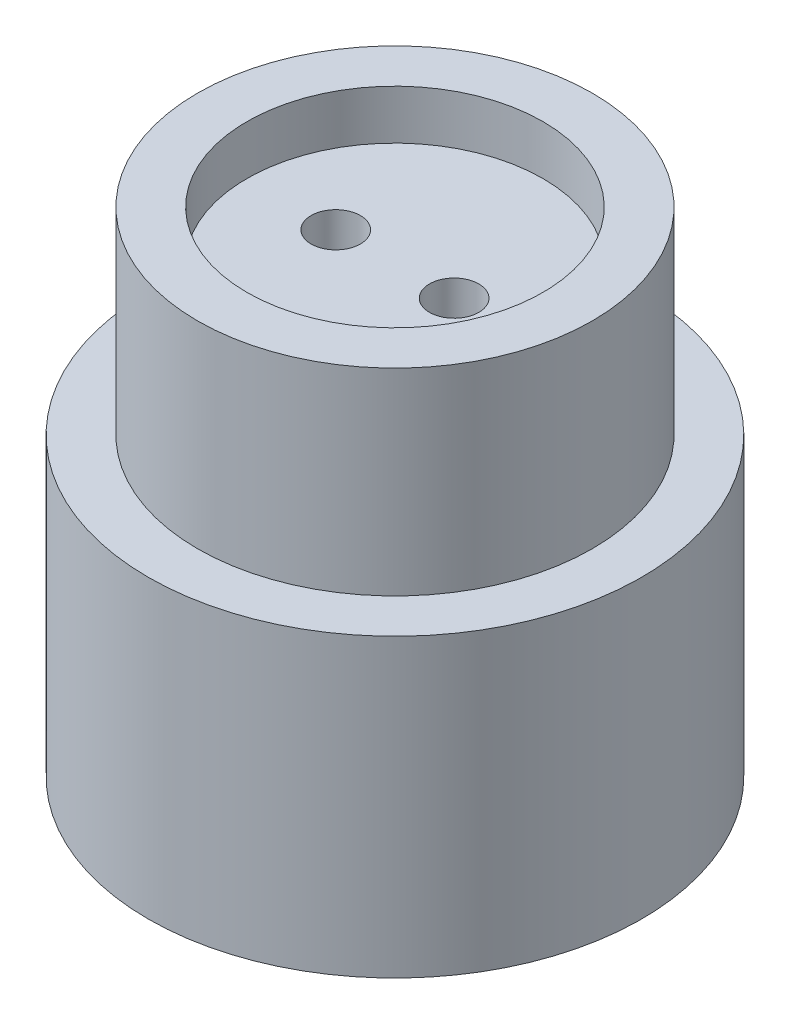
ISO-10303-21;
HEADER;
FILE_DESCRIPTION(('STEP AP214'),'2;1');
FILE_NAME('part.step','',(''),(''),'','','');
FILE_SCHEMA(('AUTOMOTIVE_DESIGN { 1 0 10303 214 1 1 1 1 }'));
ENDSEC;
DATA;
#1=APPLICATION_CONTEXT('core data for automotive mechanical design processes');
#2=APPLICATION_PROTOCOL_DEFINITION('international standard','automotive_design',2000,#1);
#3=PRODUCT_CONTEXT('',#1,'mechanical');
#4=PRODUCT('Part','Part','',(#3));
#5=PRODUCT_RELATED_PRODUCT_CATEGORY('part','',(#4));
#6=PRODUCT_DEFINITION_FORMATION('','',#4);
#7=PRODUCT_DEFINITION_CONTEXT('part definition',#1,'design');
#8=PRODUCT_DEFINITION('design','',#6,#7);
#9=PRODUCT_DEFINITION_SHAPE('','',#8);
#10=(LENGTH_UNIT() NAMED_UNIT(*) SI_UNIT(.MILLI.,.METRE.));
#11=(NAMED_UNIT(*) PLANE_ANGLE_UNIT() SI_UNIT($,.RADIAN.));
#12=(NAMED_UNIT(*) SI_UNIT($,.STERADIAN.) SOLID_ANGLE_UNIT());
#13=UNCERTAINTY_MEASURE_WITH_UNIT(LENGTH_MEASURE(1.E-05),#10,'distance_accuracy_value','');
#14=(GEOMETRIC_REPRESENTATION_CONTEXT(3) GLOBAL_UNCERTAINTY_ASSIGNED_CONTEXT((#13)) GLOBAL_UNIT_ASSIGNED_CONTEXT((#10,
#11,#12)) REPRESENTATION_CONTEXT('',''));
#15=CARTESIAN_POINT('',(0.,0.,0.));
#16=DIRECTION('',(0.,0.,1.));
#17=DIRECTION('',(1.,0.,0.));
#18=AXIS2_PLACEMENT_3D('',#15,#16,#17);
#19=CARTESIAN_POINT('',(0.,50.,0.));
#20=DIRECTION('',(0.,-1.,0.));
#21=DIRECTION('',(0.,0.,-1.));
#22=AXIS2_PLACEMENT_3D('',#19,#20,#21);
#23=CYLINDRICAL_SURFACE('',#22,20.);
#24=CARTESIAN_POINT('',(0.,0.,0.));
#25=DIRECTION('',(0.,1.,0.));
#26=DIRECTION('',(0.,0.,1.));
#27=AXIS2_PLACEMENT_3D('',#24,#25,#26);
#28=CIRCLE('',#27,20.);
#29=CARTESIAN_POINT('',(0.,0.,20.));
#30=VERTEX_POINT('',#29);
#31=EDGE_CURVE('E45',#30,#30,#28,.T.);
#32=ORIENTED_EDGE('',*,*,#31,.T.);
#33=EDGE_LOOP('',(#32));
#34=FACE_BOUND('',#33,.T.);
#35=CARTESIAN_POINT('',(0.,5.,0.));
#36=DIRECTION('',(0.,1.,0.));
#37=DIRECTION('',(0.,0.,1.));
#38=AXIS2_PLACEMENT_3D('',#35,#36,#37);
#39=CIRCLE('',#38,20.);
#40=CARTESIAN_POINT('',(0.,5.,20.));
#41=VERTEX_POINT('',#40);
#42=EDGE_CURVE('E65',#41,#41,#39,.T.);
#43=ORIENTED_EDGE('',*,*,#42,.F.);
#44=EDGE_LOOP('',(#43));
#45=FACE_BOUND('',#44,.T.);
#46=ADVANCED_FACE('F42',(#34,#45),#23,.T.);
#47=CARTESIAN_POINT('',(0.,0.,0.));
#48=DIRECTION('',(0.,1.,0.));
#49=DIRECTION('',(0.,0.,1.));
#50=AXIS2_PLACEMENT_3D('',#47,#48,#49);
#51=PLANE('',#50);
#52=CARTESIAN_POINT('',(13.,0.,0.));
#53=DIRECTION('',(0.,1.,0.));
#54=DIRECTION('',(0.,0.,1.));
#55=AXIS2_PLACEMENT_3D('',#52,#53,#54);
#56=CIRCLE('',#55,2.5);
#57=CARTESIAN_POINT('',(13.,0.,2.5));
#58=VERTEX_POINT('',#57);
#59=EDGE_CURVE('E105',#58,#58,#56,.T.);
#60=ORIENTED_EDGE('',*,*,#59,.T.);
#61=EDGE_LOOP('',(#60));
#62=FACE_BOUND('',#61,.T.);
#63=CARTESIAN_POINT('',(-13.,0.,0.));
#64=DIRECTION('',(0.,1.,0.));
#65=DIRECTION('',(0.,0.,1.));
#66=AXIS2_PLACEMENT_3D('',#63,#64,#65);
#67=CIRCLE('',#66,2.5);
#68=CARTESIAN_POINT('',(-13.,0.,2.5));
#69=VERTEX_POINT('',#68);
#70=EDGE_CURVE('E95',#69,#69,#67,.T.);
#71=ORIENTED_EDGE('',*,*,#70,.T.);
#72=EDGE_LOOP('',(#71));
#73=FACE_BOUND('',#72,.T.);
#74=ORIENTED_EDGE('',*,*,#31,.F.);
#75=EDGE_LOOP('',(#74));
#76=FACE_BOUND('',#75,.T.);
#77=ADVANCED_FACE('F142',(#62,#73,#76),#51,.F.);
#78=CARTESIAN_POINT('',(-15.,42.,0.));
#79=DIRECTION('',(0.,-1.,0.));
#80=DIRECTION('',(0.,0.,-1.));
#81=AXIS2_PLACEMENT_3D('',#78,#79,#80);
#82=PLANE('',#81);
#83=CARTESIAN_POINT('',(0.,42.,0.));
#84=DIRECTION('',(0.,1.,0.));
#85=DIRECTION('',(0.,0.,1.));
#86=AXIS2_PLACEMENT_3D('',#83,#84,#85);
#87=CIRCLE('',#86,9.50000000000001);
#88=CARTESIAN_POINT('',(0.,42.,9.50000000000001));
#89=VERTEX_POINT('',#88);
#90=EDGE_CURVE('E52',#89,#89,#87,.T.);
#91=ORIENTED_EDGE('',*,*,#90,.T.);
#92=EDGE_LOOP('',(#91));
#93=FACE_BOUND('',#92,.T.);
#94=CARTESIAN_POINT('',(0.,42.,0.));
#95=DIRECTION('',(0.,1.,0.));
#96=DIRECTION('',(0.,0.,1.));
#97=AXIS2_PLACEMENT_3D('',#94,#95,#96);
#98=CIRCLE('',#97,15.);
#99=CARTESIAN_POINT('',(0.,42.,15.));
#100=VERTEX_POINT('',#99);
#101=EDGE_CURVE('E74',#100,#100,#98,.T.);
#102=ORIENTED_EDGE('',*,*,#101,.F.);
#103=EDGE_LOOP('',(#102));
#104=FACE_BOUND('',#103,.T.);
#105=ADVANCED_FACE('F148',(#93,#104),#82,.T.);
#106=CARTESIAN_POINT('',(0.,50.,0.));
#107=DIRECTION('',(0.,1.,0.));
#108=DIRECTION('',(0.,0.,1.));
#109=AXIS2_PLACEMENT_3D('',#106,#107,#108);
#110=CYLINDRICAL_SURFACE('',#109,9.50000000000001);
#111=CARTESIAN_POINT('',(0.,23.5,0.));
#112=DIRECTION('',(0.,1.,0.));
#113=DIRECTION('',(0.,0.,1.));
#114=AXIS2_PLACEMENT_3D('',#111,#112,#113);
#115=CIRCLE('',#114,9.50000000000001);
#116=CARTESIAN_POINT('',(0.,23.5,9.50000000000001));
#117=VERTEX_POINT('',#116);
#118=EDGE_CURVE('E56',#117,#117,#115,.T.);
#119=ORIENTED_EDGE('',*,*,#118,.T.);
#120=EDGE_LOOP('',(#119));
#121=FACE_BOUND('',#120,.T.);
#122=ORIENTED_EDGE('',*,*,#90,.F.);
#123=EDGE_LOOP('',(#122));
#124=FACE_BOUND('',#123,.T.);
#125=ADVANCED_FACE('F189',(#121,#124),#110,.T.);
#126=CARTESIAN_POINT('',(-9.50000000000001,23.5,0.));
#127=DIRECTION('',(0.,1.,0.));
#128=DIRECTION('',(0.,0.,1.));
#129=AXIS2_PLACEMENT_3D('',#126,#127,#128);
#130=PLANE('',#129);
#131=CARTESIAN_POINT('',(0.,23.5,0.));
#132=DIRECTION('',(0.,1.,0.));
#133=DIRECTION('',(0.,0.,1.));
#134=AXIS2_PLACEMENT_3D('',#131,#132,#133);
#135=CIRCLE('',#134,16.5);
#136=CARTESIAN_POINT('',(0.,23.5,16.5));
#137=VERTEX_POINT('',#136);
#138=EDGE_CURVE('E59',#137,#137,#135,.T.);
#139=ORIENTED_EDGE('',*,*,#138,.T.);
#140=EDGE_LOOP('',(#139));
#141=FACE_BOUND('',#140,.T.);
#142=ORIENTED_EDGE('',*,*,#118,.F.);
#143=EDGE_LOOP('',(#142));
#144=FACE_BOUND('',#143,.T.);
#145=ADVANCED_FACE('F185',(#141,#144),#130,.T.);
#146=CARTESIAN_POINT('',(0.,50.,0.));
#147=DIRECTION('',(0.,1.,0.));
#148=DIRECTION('',(0.,0.,1.));
#149=AXIS2_PLACEMENT_3D('',#146,#147,#148);
#150=CYLINDRICAL_SURFACE('',#149,16.5);
#151=CARTESIAN_POINT('',(0.,5.,0.));
#152=DIRECTION('',(0.,1.,0.));
#153=DIRECTION('',(0.,0.,1.));
#154=AXIS2_PLACEMENT_3D('',#151,#152,#153);
#155=CIRCLE('',#154,16.5);
#156=CARTESIAN_POINT('',(0.,5.,16.5));
#157=VERTEX_POINT('',#156);
#158=EDGE_CURVE('E62',#157,#157,#155,.T.);
#159=ORIENTED_EDGE('',*,*,#158,.T.);
#160=EDGE_LOOP('',(#159));
#161=FACE_BOUND('',#160,.T.);
#162=ORIENTED_EDGE('',*,*,#138,.F.);
#163=EDGE_LOOP('',(#162));
#164=FACE_BOUND('',#163,.T.);
#165=ADVANCED_FACE('F178',(#161,#164),#150,.T.);
#166=CARTESIAN_POINT('',(-16.5,5.,0.));
#167=DIRECTION('',(0.,1.,0.));
#168=DIRECTION('',(0.,0.,1.));
#169=AXIS2_PLACEMENT_3D('',#166,#167,#168);
#170=PLANE('',#169);
#171=ORIENTED_EDGE('',*,*,#42,.T.);
#172=EDGE_LOOP('',(#171));
#173=FACE_BOUND('',#172,.T.);
#174=ORIENTED_EDGE('',*,*,#158,.F.);
#175=EDGE_LOOP('',(#174));
#176=FACE_BOUND('',#175,.T.);
#177=ADVANCED_FACE('F169',(#173,#176),#170,.T.);
#178=CARTESIAN_POINT('',(-20.,25.,0.));
#179=DIRECTION('',(0.,-1.,0.));
#180=DIRECTION('',(0.,0.,-1.));
#181=AXIS2_PLACEMENT_3D('',#178,#179,#180);
#182=PLANE('',#181);
#183=CARTESIAN_POINT('',(0.,25.,0.));
#184=DIRECTION('',(0.,1.,0.));
#185=DIRECTION('',(0.,0.,1.));
#186=AXIS2_PLACEMENT_3D('',#183,#184,#185);
#187=CIRCLE('',#186,15.);
#188=CARTESIAN_POINT('',(0.,25.,15.));
#189=VERTEX_POINT('',#188);
#190=EDGE_CURVE('E71',#189,#189,#187,.T.);
#191=ORIENTED_EDGE('',*,*,#190,.T.);
#192=EDGE_LOOP('',(#191));
#193=FACE_BOUND('',#192,.T.);
#194=CARTESIAN_POINT('',(0.,25.,0.));
#195=DIRECTION('',(0.,1.,0.));
#196=DIRECTION('',(0.,0.,1.));
#197=AXIS2_PLACEMENT_3D('',#194,#195,#196);
#198=CIRCLE('',#197,20.);
#199=CARTESIAN_POINT('',(0.,25.,20.));
#200=VERTEX_POINT('',#199);
#201=EDGE_CURVE('E68',#200,#200,#198,.T.);
#202=ORIENTED_EDGE('',*,*,#201,.F.);
#203=EDGE_LOOP('',(#202));
#204=FACE_BOUND('',#203,.T.);
#205=ADVANCED_FACE('F167',(#193,#204),#182,.T.);
#206=CARTESIAN_POINT('',(0.,50.,0.));
#207=DIRECTION('',(0.,1.,0.));
#208=DIRECTION('',(0.,0.,1.));
#209=AXIS2_PLACEMENT_3D('',#206,#207,#208);
#210=CYLINDRICAL_SURFACE('',#209,15.);
#211=ORIENTED_EDGE('',*,*,#190,.F.);
#212=EDGE_LOOP('',(#211));
#213=FACE_BOUND('',#212,.T.);
#214=ORIENTED_EDGE('',*,*,#101,.T.);
#215=EDGE_LOOP('',(#214));
#216=FACE_BOUND('',#215,.T.);
#217=ADVANCED_FACE('F161',(#213,#216),#210,.F.);
#218=CARTESIAN_POINT('',(0.,50.,0.));
#219=DIRECTION('',(0.,1.,0.));
#220=DIRECTION('',(0.,0.,1.));
#221=AXIS2_PLACEMENT_3D('',#218,#219,#220);
#222=PLANE('',#221);
#223=CARTESIAN_POINT('',(0.,50.,0.));
#224=DIRECTION('',(0.,1.,0.));
#225=DIRECTION('',(0.,0.,1.));
#226=AXIS2_PLACEMENT_3D('',#223,#224,#225);
#227=CIRCLE('',#226,15.);
#228=CARTESIAN_POINT('',(0.,50.,15.));
#229=VERTEX_POINT('',#228);
#230=EDGE_CURVE('E92',#229,#229,#227,.T.);
#231=ORIENTED_EDGE('',*,*,#230,.F.);
#232=EDGE_LOOP('',(#231));
#233=FACE_BOUND('',#232,.T.);
#234=CARTESIAN_POINT('',(0.,50.,0.));
#235=DIRECTION('',(0.,1.,0.));
#236=DIRECTION('',(0.,0.,1.));
#237=AXIS2_PLACEMENT_3D('',#234,#235,#236);
#238=CIRCLE('',#237,20.);
#239=CARTESIAN_POINT('',(0.,50.,20.));
#240=VERTEX_POINT('',#239);
#241=EDGE_CURVE('E11',#240,#240,#238,.T.);
#242=ORIENTED_EDGE('',*,*,#241,.T.);
#243=EDGE_LOOP('',(#242));
#244=FACE_BOUND('',#243,.T.);
#245=ADVANCED_FACE('F153',(#233,#244),#222,.T.);
#246=ORIENTED_EDGE('',*,*,#241,.F.);
#247=EDGE_LOOP('',(#246));
#248=FACE_BOUND('',#247,.T.);
#249=ORIENTED_EDGE('',*,*,#201,.T.);
#250=EDGE_LOOP('',(#249));
#251=FACE_BOUND('',#250,.T.);
#252=ADVANCED_FACE('F144',(#248,#251),#23,.T.);
#253=CARTESIAN_POINT('',(0.,50.,0.));
#254=DIRECTION('',(0.,1.,0.));
#255=DIRECTION('',(0.,0.,1.));
#256=AXIS2_PLACEMENT_3D('',#253,#254,#255);
#257=CYLINDRICAL_SURFACE('',#256,15.);
#258=CARTESIAN_POINT('',(0.,45.,0.));
#259=DIRECTION('',(0.,1.,0.));
#260=DIRECTION('',(0.,0.,1.));
#261=AXIS2_PLACEMENT_3D('',#258,#259,#260);
#262=CIRCLE('',#261,15.);
#263=CARTESIAN_POINT('',(0.,45.,15.));
#264=VERTEX_POINT('',#263);
#265=EDGE_CURVE('E85',#264,#264,#262,.T.);
#266=ORIENTED_EDGE('',*,*,#265,.F.);
#267=EDGE_LOOP('',(#266));
#268=FACE_BOUND('',#267,.T.);
#269=ORIENTED_EDGE('',*,*,#230,.T.);
#270=EDGE_LOOP('',(#269));
#271=FACE_BOUND('',#270,.T.);
#272=ADVANCED_FACE('F152',(#268,#271),#257,.F.);
#273=CARTESIAN_POINT('',(-15.,45.,0.));
#274=DIRECTION('',(0.,-1.,0.));
#275=DIRECTION('',(0.,0.,-1.));
#276=AXIS2_PLACEMENT_3D('',#273,#274,#275);
#277=PLANE('',#276);
#278=CARTESIAN_POINT('',(6.00000000000001,45.,0.));
#279=DIRECTION('',(0.,-1.,0.));
#280=DIRECTION('',(0.,0.,-1.));
#281=AXIS2_PLACEMENT_3D('',#278,#279,#280);
#282=CIRCLE('',#281,2.5);
#283=CARTESIAN_POINT('',(6.00000000000001,45.,-2.5));
#284=VERTEX_POINT('',#283);
#285=EDGE_CURVE('E110',#284,#284,#282,.T.);
#286=ORIENTED_EDGE('',*,*,#285,.T.);
#287=EDGE_LOOP('',(#286));
#288=FACE_BOUND('',#287,.T.);
#289=CARTESIAN_POINT('',(-6.00000000000001,45.,0.));
#290=DIRECTION('',(0.,-1.,0.));
#291=DIRECTION('',(0.,0.,-1.));
#292=AXIS2_PLACEMENT_3D('',#289,#290,#291);
#293=CIRCLE('',#292,2.5);
#294=CARTESIAN_POINT('',(-6.00000000000001,45.,-2.5));
#295=VERTEX_POINT('',#294);
#296=EDGE_CURVE('E98',#295,#295,#293,.T.);
#297=ORIENTED_EDGE('',*,*,#296,.T.);
#298=EDGE_LOOP('',(#297));
#299=FACE_BOUND('',#298,.T.);
#300=ORIENTED_EDGE('',*,*,#265,.T.);
#301=EDGE_LOOP('',(#300));
#302=FACE_BOUND('',#301,.T.);
#303=ADVANCED_FACE('F139',(#288,#299,#302),#277,.F.);
#304=CARTESIAN_POINT('',(-13.,25.6,0.));
#305=DIRECTION('',(0.,-1.,0.));
#306=DIRECTION('',(1.,0.,0.));
#307=AXIS2_PLACEMENT_3D('',#304,#305,#306);
#308=CYLINDRICAL_SURFACE('',#307,2.5);
#309=ORIENTED_EDGE('',*,*,#70,.F.);
#310=EDGE_LOOP('',(#309));
#311=FACE_BOUND('',#310,.T.);
#312=CARTESIAN_POINT('',(-13.,20.,0.));
#313=DIRECTION('',(-0.707106781186548,-0.707106781186548,0.));
#314=DIRECTION('',(-0.707106781186548,0.707106781186547,0.));
#315=AXIS2_PLACEMENT_3D('',#312,#313,#314);
#316=ELLIPSE('',#315,3.53553390593274,2.5);
#317=CARTESIAN_POINT('',(-15.5,22.5,0.));
#318=VERTEX_POINT('',#317);
#319=EDGE_CURVE('E102',#318,#318,#316,.T.);
#320=ORIENTED_EDGE('',*,*,#319,.F.);
#321=EDGE_LOOP('',(#320));
#322=FACE_BOUND('',#321,.T.);
#323=ADVANCED_FACE('F307',(#311,#322),#308,.F.);
#324=CARTESIAN_POINT('',(-0.400000000000011,20.,0.));
#325=DIRECTION('',(-1.,0.,0.));
#326=DIRECTION('',(0.,-1.,0.));
#327=AXIS2_PLACEMENT_3D('',#324,#325,#326);
#328=CYLINDRICAL_SURFACE('',#327,2.5);
#329=CARTESIAN_POINT('',(-6.00000000000001,20.,0.));
#330=DIRECTION('',(-0.707106781186547,-0.707106781186548,0.));
#331=DIRECTION('',(0.707106781186548,-0.707106781186547,0.));
#332=AXIS2_PLACEMENT_3D('',#329,#330,#331);
#333=ELLIPSE('',#332,3.53553390593274,2.5);
#334=CARTESIAN_POINT('',(-3.50000000000001,17.5,0.));
#335=VERTEX_POINT('',#334);
#336=EDGE_CURVE('E101',#335,#335,#333,.T.);
#337=ORIENTED_EDGE('',*,*,#336,.F.);
#338=EDGE_LOOP('',(#337));
#339=FACE_BOUND('',#338,.T.);
#340=ORIENTED_EDGE('',*,*,#319,.T.);
#341=EDGE_LOOP('',(#340));
#342=FACE_BOUND('',#341,.T.);
#343=ADVANCED_FACE('F136',(#339,#342),#328,.F.);
#344=CARTESIAN_POINT('',(-6.00000000000001,50.,0.));
#345=DIRECTION('',(0.,-1.,0.));
#346=DIRECTION('',(1.,0.,0.));
#347=AXIS2_PLACEMENT_3D('',#344,#345,#346);
#348=CYLINDRICAL_SURFACE('',#347,2.5);
#349=ORIENTED_EDGE('',*,*,#296,.F.);
#350=EDGE_LOOP('',(#349));
#351=FACE_BOUND('',#350,.T.);
#352=ORIENTED_EDGE('',*,*,#336,.T.);
#353=EDGE_LOOP('',(#352));
#354=FACE_BOUND('',#353,.T.);
#355=ADVANCED_FACE('F130',(#351,#354),#348,.F.);
#356=CARTESIAN_POINT('',(13.,25.6,0.));
#357=DIRECTION('',(0.,-1.,0.));
#358=DIRECTION('',(1.,0.,0.));
#359=AXIS2_PLACEMENT_3D('',#356,#357,#358);
#360=CYLINDRICAL_SURFACE('',#359,2.5);
#361=ORIENTED_EDGE('',*,*,#59,.F.);
#362=EDGE_LOOP('',(#361));
#363=FACE_BOUND('',#362,.T.);
#364=CARTESIAN_POINT('',(13.,20.,0.));
#365=DIRECTION('',(0.707106781186547,-0.707106781186548,0.));
#366=DIRECTION('',(0.707106781186548,0.707106781186547,0.));
#367=AXIS2_PLACEMENT_3D('',#364,#365,#366);
#368=ELLIPSE('',#367,3.53553390593274,2.5);
#369=CARTESIAN_POINT('',(15.5,22.5,0.));
#370=VERTEX_POINT('',#369);
#371=EDGE_CURVE('E114',#370,#370,#368,.T.);
#372=ORIENTED_EDGE('',*,*,#371,.F.);
#373=EDGE_LOOP('',(#372));
#374=FACE_BOUND('',#373,.T.);
#375=ADVANCED_FACE('F125',(#363,#374),#360,.F.);
#376=CARTESIAN_POINT('',(0.400000000000011,20.,0.));
#377=DIRECTION('',(1.,0.,0.));
#378=DIRECTION('',(0.,1.,0.));
#379=AXIS2_PLACEMENT_3D('',#376,#377,#378);
#380=CYLINDRICAL_SURFACE('',#379,2.5);
#381=CARTESIAN_POINT('',(6.00000000000001,20.,0.));
#382=DIRECTION('',(0.707106781186547,-0.707106781186548,0.));
#383=DIRECTION('',(-0.707106781186548,-0.707106781186547,0.));
#384=AXIS2_PLACEMENT_3D('',#381,#382,#383);
#385=ELLIPSE('',#384,3.53553390593274,2.5);
#386=CARTESIAN_POINT('',(3.50000000000001,17.5,0.));
#387=VERTEX_POINT('',#386);
#388=EDGE_CURVE('E113',#387,#387,#385,.T.);
#389=ORIENTED_EDGE('',*,*,#388,.F.);
#390=EDGE_LOOP('',(#389));
#391=FACE_BOUND('',#390,.T.);
#392=ORIENTED_EDGE('',*,*,#371,.T.);
#393=EDGE_LOOP('',(#392));
#394=FACE_BOUND('',#393,.T.);
#395=ADVANCED_FACE('F122',(#391,#394),#380,.F.);
#396=CARTESIAN_POINT('',(6.00000000000001,50.,0.));
#397=DIRECTION('',(0.,-1.,0.));
#398=DIRECTION('',(1.,0.,0.));
#399=AXIS2_PLACEMENT_3D('',#396,#397,#398);
#400=CYLINDRICAL_SURFACE('',#399,2.5);
#401=ORIENTED_EDGE('',*,*,#285,.F.);
#402=EDGE_LOOP('',(#401));
#403=FACE_BOUND('',#402,.T.);
#404=ORIENTED_EDGE('',*,*,#388,.T.);
#405=EDGE_LOOP('',(#404));
#406=FACE_BOUND('',#405,.T.);
#407=ADVANCED_FACE('F120',(#403,#406),#400,.F.);
#408=CLOSED_SHELL('',(#46,#77,#105,#125,#145,#165,#177,#205,#217,#245,#252,#272,#303,#323,#343,
#355,#375,#395,#407));
#409=CARTESIAN_POINT('',(-2.50000000000001,42.,0.));
#410=DIRECTION('',(0.,-1.,0.));
#411=DIRECTION('',(0.,0.,-1.));
#412=AXIS2_PLACEMENT_3D('',#409,#410,#411);
#413=PLANE('',#412);
#414=CARTESIAN_POINT('',(0.,42.,0.));
#415=DIRECTION('',(0.,1.,0.));
#416=DIRECTION('',(0.,0.,1.));
#417=AXIS2_PLACEMENT_3D('',#414,#415,#416);
#418=CIRCLE('',#417,2.50000000000001);
#419=CARTESIAN_POINT('',(0.,42.,2.50000000000001));
#420=VERTEX_POINT('',#419);
#421=EDGE_CURVE('E81',#420,#420,#418,.T.);
#422=ORIENTED_EDGE('',*,*,#421,.F.);
#423=EDGE_LOOP('',(#422));
#424=FACE_BOUND('',#423,.T.);
#425=ADVANCED_FACE('F243',(#424),#413,.T.);
#426=CARTESIAN_POINT('',(0.,50.,0.));
#427=DIRECTION('',(0.,1.,0.));
#428=DIRECTION('',(0.,0.,1.));
#429=AXIS2_PLACEMENT_3D('',#426,#427,#428);
#430=CYLINDRICAL_SURFACE('',#429,2.50000000000001);
#431=CARTESIAN_POINT('',(0.,16.5,0.));
#432=DIRECTION('',(0.,1.,0.));
#433=DIRECTION('',(0.,0.,1.));
#434=AXIS2_PLACEMENT_3D('',#431,#432,#433);
#435=CIRCLE('',#434,2.5);
#436=CARTESIAN_POINT('',(0.,16.5,2.5));
#437=VERTEX_POINT('',#436);
#438=EDGE_CURVE('E77',#437,#437,#435,.T.);
#439=ORIENTED_EDGE('',*,*,#438,.F.);
#440=EDGE_LOOP('',(#439));
#441=FACE_BOUND('',#440,.T.);
#442=ORIENTED_EDGE('',*,*,#421,.T.);
#443=EDGE_LOOP('',(#442));
#444=FACE_BOUND('',#443,.T.);
#445=ADVANCED_FACE('F247',(#441,#444),#430,.F.);
#446=CARTESIAN_POINT('',(-9.50000000000001,5.,0.));
#447=DIRECTION('',(0.,-1.,0.));
#448=DIRECTION('',(0.,0.,-1.));
#449=AXIS2_PLACEMENT_3D('',#446,#447,#448);
#450=PLANE('',#449);
#451=CARTESIAN_POINT('',(0.,5.,0.));
#452=DIRECTION('',(0.,1.,0.));
#453=DIRECTION('',(0.,0.,1.));
#454=AXIS2_PLACEMENT_3D('',#451,#452,#453);
#455=CIRCLE('',#454,9.50000000000001);
#456=CARTESIAN_POINT('',(0.,5.,9.50000000000001));
#457=VERTEX_POINT('',#456);
#458=EDGE_CURVE('E78',#457,#457,#455,.T.);
#459=ORIENTED_EDGE('',*,*,#458,.T.);
#460=EDGE_LOOP('',(#459));
#461=FACE_BOUND('',#460,.T.);
#462=ADVANCED_FACE('F259',(#461),#450,.F.);
#463=CARTESIAN_POINT('',(0.,50.,0.));
#464=DIRECTION('',(0.,1.,0.));
#465=DIRECTION('',(0.,0.,1.));
#466=AXIS2_PLACEMENT_3D('',#463,#464,#465);
#467=CYLINDRICAL_SURFACE('',#466,9.50000000000001);
#468=ORIENTED_EDGE('',*,*,#458,.F.);
#469=EDGE_LOOP('',(#468));
#470=FACE_BOUND('',#469,.T.);
#471=CARTESIAN_POINT('',(0.,16.5,0.));
#472=DIRECTION('',(0.,1.,0.));
#473=DIRECTION('',(0.,0.,1.));
#474=AXIS2_PLACEMENT_3D('',#471,#472,#473);
#475=CIRCLE('',#474,9.50000000000001);
#476=CARTESIAN_POINT('',(0.,16.5,9.50000000000001));
#477=VERTEX_POINT('',#476);
#478=EDGE_CURVE('E82',#477,#477,#475,.T.);
#479=ORIENTED_EDGE('',*,*,#478,.T.);
#480=EDGE_LOOP('',(#479));
#481=FACE_BOUND('',#480,.T.);
#482=ADVANCED_FACE('F270',(#470,#481),#467,.F.);
#483=CARTESIAN_POINT('',(-9.50000000000001,16.5,0.));
#484=DIRECTION('',(0.,-1.,0.));
#485=DIRECTION('',(0.,0.,-1.));
#486=AXIS2_PLACEMENT_3D('',#483,#484,#485);
#487=PLANE('',#486);
#488=ORIENTED_EDGE('',*,*,#438,.T.);
#489=EDGE_LOOP('',(#488));
#490=FACE_BOUND('',#489,.T.);
#491=ORIENTED_EDGE('',*,*,#478,.F.);
#492=EDGE_LOOP('',(#491));
#493=FACE_BOUND('',#492,.T.);
#494=ADVANCED_FACE('F262',(#490,#493),#487,.T.);
#495=CLOSED_SHELL('',(#425,#445,#462,#482,#494));
#496=ORIENTED_CLOSED_SHELL('',*,#495,.T.);
#497=BREP_WITH_VOIDS('B2',#408,(#496));
#498=CARTESIAN_POINT('',(0.,30.,0.));
#499=DIRECTION('',(0.,1.,0.));
#500=DIRECTION('',(0.,0.,1.));
#501=AXIS2_PLACEMENT_3D('',#498,#499,#500);
#502=PLANE('',#501);
#503=CARTESIAN_POINT('',(0.,30.,0.));
#504=DIRECTION('',(0.,1.,0.));
#505=DIRECTION('',(0.,0.,1.));
#506=AXIS2_PLACEMENT_3D('',#503,#504,#505);
#507=CIRCLE('',#506,25.);
#508=CARTESIAN_POINT('',(0.,30.,25.));
#509=VERTEX_POINT('',#508);
#510=EDGE_CURVE('E40',#509,#509,#507,.T.);
#511=ORIENTED_EDGE('',*,*,#510,.T.);
#512=EDGE_LOOP('',(#511));
#513=FACE_BOUND('',#512,.T.);
#514=CARTESIAN_POINT('',(0.,30.,0.));
#515=DIRECTION('',(0.,1.,0.));
#516=DIRECTION('',(0.,0.,1.));
#517=AXIS2_PLACEMENT_3D('',#514,#515,#516);
#518=CIRCLE('',#517,20.);
#519=CARTESIAN_POINT('',(0.,30.,20.));
#520=VERTEX_POINT('',#519);
#521=EDGE_CURVE('E416',#520,#520,#518,.T.);
#522=ORIENTED_EDGE('',*,*,#521,.F.);
#523=EDGE_LOOP('',(#522));
#524=FACE_BOUND('',#523,.T.);
#525=ADVANCED_FACE('F405',(#513,#524),#502,.T.);
#526=CARTESIAN_POINT('',(0.,0.,0.));
#527=DIRECTION('',(0.,1.,0.));
#528=DIRECTION('',(0.,0.,1.));
#529=AXIS2_PLACEMENT_3D('',#526,#527,#528);
#530=PLANE('',#529);
#531=CARTESIAN_POINT('',(0.,0.,0.));
#532=DIRECTION('',(0.,1.,0.));
#533=DIRECTION('',(0.,0.,1.));
#534=AXIS2_PLACEMENT_3D('',#531,#532,#533);
#535=CIRCLE('',#534,25.);
#536=CARTESIAN_POINT('',(0.,0.,25.));
#537=VERTEX_POINT('',#536);
#538=EDGE_CURVE('E409',#537,#537,#535,.T.);
#539=ORIENTED_EDGE('',*,*,#538,.F.);
#540=EDGE_LOOP('',(#539));
#541=FACE_BOUND('',#540,.T.);
#542=CARTESIAN_POINT('',(0.,0.,0.));
#543=DIRECTION('',(0.,1.,0.));
#544=DIRECTION('',(0.,0.,1.));
#545=AXIS2_PLACEMENT_3D('',#542,#543,#544);
#546=CIRCLE('',#545,20.);
#547=CARTESIAN_POINT('',(0.,0.,20.));
#548=VERTEX_POINT('',#547);
#549=EDGE_CURVE('E418',#548,#548,#546,.T.);
#550=ORIENTED_EDGE('',*,*,#549,.T.);
#551=EDGE_LOOP('',(#550));
#552=FACE_BOUND('',#551,.T.);
#553=ADVANCED_FACE('F428',(#541,#552),#530,.F.);
#554=CARTESIAN_POINT('',(0.,30.,0.));
#555=DIRECTION('',(0.,-1.,0.));
#556=DIRECTION('',(0.,0.,-1.));
#557=AXIS2_PLACEMENT_3D('',#554,#555,#556);
#558=CYLINDRICAL_SURFACE('',#557,25.);
#559=ORIENTED_EDGE('',*,*,#510,.F.);
#560=EDGE_LOOP('',(#559));
#561=FACE_BOUND('',#560,.T.);
#562=ORIENTED_EDGE('',*,*,#538,.T.);
#563=EDGE_LOOP('',(#562));
#564=FACE_BOUND('',#563,.T.);
#565=ADVANCED_FACE('F407',(#561,#564),#558,.T.);
#566=CARTESIAN_POINT('',(0.,30.,0.));
#567=DIRECTION('',(0.,-1.,0.));
#568=DIRECTION('',(0.,0.,-1.));
#569=AXIS2_PLACEMENT_3D('',#566,#567,#568);
#570=CYLINDRICAL_SURFACE('',#569,20.);
#571=ORIENTED_EDGE('',*,*,#521,.T.);
#572=EDGE_LOOP('',(#571));
#573=FACE_BOUND('',#572,.T.);
#574=ORIENTED_EDGE('',*,*,#549,.F.);
#575=EDGE_LOOP('',(#574));
#576=FACE_BOUND('',#575,.T.);
#577=ADVANCED_FACE('F424',(#573,#576),#570,.F.);
#578=CLOSED_SHELL('',(#525,#553,#565,#577));
#579=MANIFOLD_SOLID_BREP('B6',#578);
#580=ADVANCED_BREP_SHAPE_REPRESENTATION('',(#18,#497,#579),#14);
#581=SHAPE_DEFINITION_REPRESENTATION(#9,#580);
ENDSEC;
END-ISO-10303-21;
